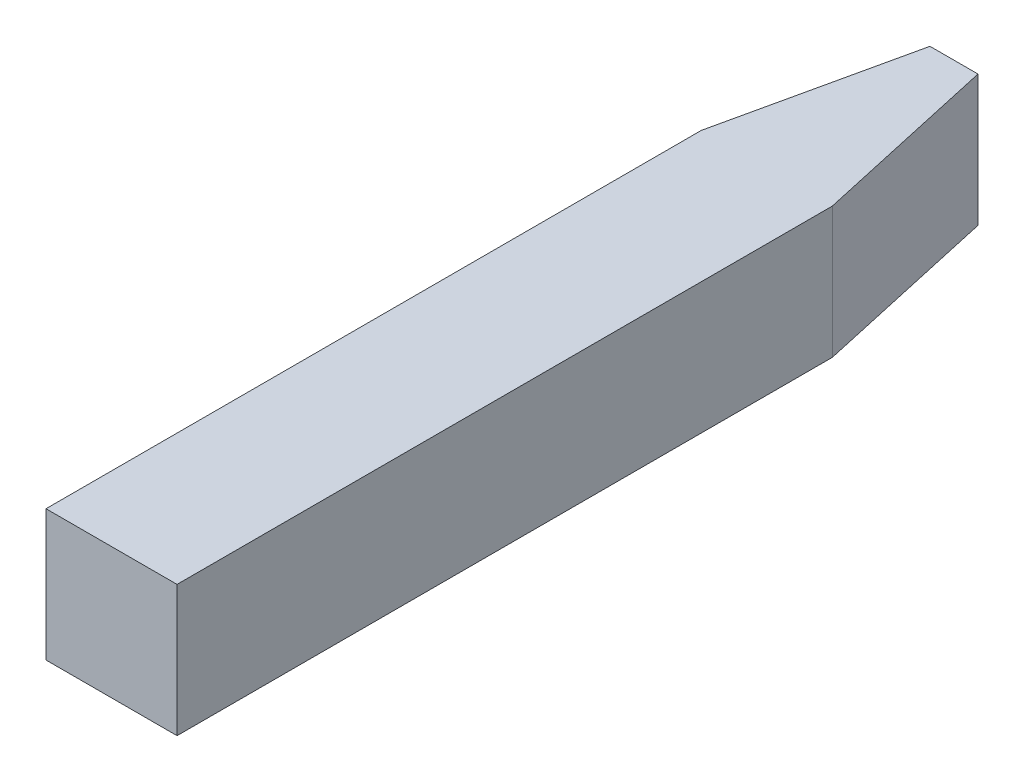
ISO-10303-21;
HEADER;
FILE_DESCRIPTION(('STEP AP214'),'2;1');
FILE_NAME('part.step','',(''),(''),'','','');
FILE_SCHEMA(('AUTOMOTIVE_DESIGN { 1 0 10303 214 1 1 1 1 }'));
ENDSEC;
DATA;
#1=APPLICATION_CONTEXT('core data for automotive mechanical design processes');
#2=APPLICATION_PROTOCOL_DEFINITION('international standard','automotive_design',2000,#1);
#3=PRODUCT_CONTEXT('',#1,'mechanical');
#4=PRODUCT('Part','Part','',(#3));
#5=PRODUCT_RELATED_PRODUCT_CATEGORY('part','',(#4));
#6=PRODUCT_DEFINITION_FORMATION('','',#4);
#7=PRODUCT_DEFINITION_CONTEXT('part definition',#1,'design');
#8=PRODUCT_DEFINITION('design','',#6,#7);
#9=PRODUCT_DEFINITION_SHAPE('','',#8);
#10=(LENGTH_UNIT() NAMED_UNIT(*) SI_UNIT(.MILLI.,.METRE.));
#11=(NAMED_UNIT(*) PLANE_ANGLE_UNIT() SI_UNIT($,.RADIAN.));
#12=(NAMED_UNIT(*) SI_UNIT($,.STERADIAN.) SOLID_ANGLE_UNIT());
#13=UNCERTAINTY_MEASURE_WITH_UNIT(LENGTH_MEASURE(1.E-05),#10,'distance_accuracy_value','');
#14=(GEOMETRIC_REPRESENTATION_CONTEXT(3) GLOBAL_UNCERTAINTY_ASSIGNED_CONTEXT((#13)) GLOBAL_UNIT_ASSIGNED_CONTEXT((#10,
#11,#12)) REPRESENTATION_CONTEXT('',''));
#15=CARTESIAN_POINT('',(0.,0.,0.));
#16=DIRECTION('',(0.,0.,1.));
#17=DIRECTION('',(1.,0.,0.));
#18=AXIS2_PLACEMENT_3D('',#15,#16,#17);
#19=CARTESIAN_POINT('',(1.46249685,7.76042,-3.61250314999995));
#20=DIRECTION('',(0.,1.,0.));
#21=DIRECTION('',(0.,0.,-1.));
#22=AXIS2_PLACEMENT_3D('',#19,#20,#21);
#23=PLANE('',#22);
#24=DIRECTION('',(-1.,0.,0.));
#25=VECTOR('',#24,1.);
#26=CARTESIAN_POINT('',(2.18,7.76042,0.999999999999105));
#27=LINE('',#26,#25);
#28=CARTESIAN_POINT('',(2.18,7.76042,0.999999999999104));
#29=VERTEX_POINT('',#28);
#30=CARTESIAN_POINT('',(1.48,7.76042,0.999999999999104));
#31=VERTEX_POINT('',#30);
#32=EDGE_CURVE('E27',#29,#31,#27,.T.);
#33=ORIENTED_EDGE('',*,*,#32,.F.);
#34=DIRECTION('',(0.,0.,1.));
#35=VECTOR('',#34,1.);
#36=CARTESIAN_POINT('',(2.18,7.76042,-2.5));
#37=LINE('',#36,#35);
#38=CARTESIAN_POINT('',(2.18,7.76042,-2.5));
#39=VERTEX_POINT('',#38);
#40=EDGE_CURVE('E95',#39,#29,#37,.T.);
#41=ORIENTED_EDGE('',*,*,#40,.F.);
#42=DIRECTION('',(0.216439613938066,0.,0.976296007119942));
#43=VECTOR('',#42,1.);
#44=CARTESIAN_POINT('',(1.95830533735709,7.76042,-3.5));
#45=LINE('',#44,#43);
#46=CARTESIAN_POINT('',(1.95830533735709,7.76042,-3.5));
#47=VERTEX_POINT('',#46);
#48=EDGE_CURVE('E90',#47,#39,#45,.T.);
#49=ORIENTED_EDGE('',*,*,#48,.F.);
#50=DIRECTION('',(1.,0.,0.));
#51=VECTOR('',#50,1.);
#52=CARTESIAN_POINT('',(1.70169466264301,7.76042,-3.5));
#53=LINE('',#52,#51);
#54=CARTESIAN_POINT('',(1.70169466264301,7.76042,-3.5));
#55=VERTEX_POINT('',#54);
#56=EDGE_CURVE('E92',#55,#47,#53,.T.);
#57=ORIENTED_EDGE('',*,*,#56,.F.);
#58=DIRECTION('',(0.216439613938066,0.,-0.976296007119942));
#59=VECTOR('',#58,1.);
#60=CARTESIAN_POINT('',(1.48,7.76042,-2.5));
#61=LINE('',#60,#59);
#62=CARTESIAN_POINT('',(1.48,7.76042,-2.5));
#63=VERTEX_POINT('',#62);
#64=EDGE_CURVE('E129',#63,#55,#61,.T.);
#65=ORIENTED_EDGE('',*,*,#64,.F.);
#66=DIRECTION('',(0.,0.,-1.));
#67=VECTOR('',#66,1.);
#68=CARTESIAN_POINT('',(1.48,7.76042,0.999999999999104));
#69=LINE('',#68,#67);
#70=EDGE_CURVE('E151',#31,#63,#69,.T.);
#71=ORIENTED_EDGE('',*,*,#70,.F.);
#72=EDGE_LOOP('',(#33,#41,#49,#57,#65,#71));
#73=FACE_BOUND('',#72,.T.);
#74=ADVANCED_FACE('F16',(#73),#23,.T.);
#75=CARTESIAN_POINT('',(1.46249685,7.06042,1.11250314999908));
#76=DIRECTION('',(0.,-1.,0.));
#77=DIRECTION('',(-1.,0.,0.));
#78=AXIS2_PLACEMENT_3D('',#75,#76,#77);
#79=PLANE('',#78);
#80=DIRECTION('',(-0.216439613938066,0.,0.976296007119942));
#81=VECTOR('',#80,1.);
#82=CARTESIAN_POINT('',(1.7016946626429,7.06042,-3.5));
#83=LINE('',#82,#81);
#84=CARTESIAN_POINT('',(1.70169466264301,7.06042,-3.5));
#85=VERTEX_POINT('',#84);
#86=CARTESIAN_POINT('',(1.48,7.06042,-2.5));
#87=VERTEX_POINT('',#86);
#88=EDGE_CURVE('E110',#85,#87,#83,.T.);
#89=ORIENTED_EDGE('',*,*,#88,.F.);
#90=DIRECTION('',(1.,0.,0.));
#91=VECTOR('',#90,1.);
#92=CARTESIAN_POINT('',(1.70169466264301,7.06042,-3.5));
#93=LINE('',#92,#91);
#94=CARTESIAN_POINT('',(1.95830533735709,7.06042,-3.5));
#95=VERTEX_POINT('',#94);
#96=EDGE_CURVE('E114',#85,#95,#93,.T.);
#97=ORIENTED_EDGE('',*,*,#96,.T.);
#98=DIRECTION('',(-0.216439613938066,0.,-0.976296007119942));
#99=VECTOR('',#98,1.);
#100=CARTESIAN_POINT('',(2.18,7.06042,-2.5));
#101=LINE('',#100,#99);
#102=CARTESIAN_POINT('',(2.18,7.06042,-2.5));
#103=VERTEX_POINT('',#102);
#104=EDGE_CURVE('E20',#103,#95,#101,.T.);
#105=ORIENTED_EDGE('',*,*,#104,.F.);
#106=DIRECTION('',(0.,0.,-1.));
#107=VECTOR('',#106,1.);
#108=CARTESIAN_POINT('',(2.18,7.06042,0.999999999999104));
#109=LINE('',#108,#107);
#110=CARTESIAN_POINT('',(2.18,7.06042,0.999999999999104));
#111=VERTEX_POINT('',#110);
#112=EDGE_CURVE('E131',#111,#103,#109,.T.);
#113=ORIENTED_EDGE('',*,*,#112,.F.);
#114=DIRECTION('',(1.,0.,0.));
#115=VECTOR('',#114,1.);
#116=CARTESIAN_POINT('',(1.48,7.06042,0.999999999999105));
#117=LINE('',#116,#115);
#118=CARTESIAN_POINT('',(1.48,7.06042,0.999999999999104));
#119=VERTEX_POINT('',#118);
#120=EDGE_CURVE('E11',#119,#111,#117,.T.);
#121=ORIENTED_EDGE('',*,*,#120,.F.);
#122=DIRECTION('',(0.,0.,1.));
#123=VECTOR('',#122,1.);
#124=CARTESIAN_POINT('',(1.48,7.06042,-2.5));
#125=LINE('',#124,#123);
#126=EDGE_CURVE('E125',#87,#119,#125,.T.);
#127=ORIENTED_EDGE('',*,*,#126,.F.);
#128=EDGE_LOOP('',(#89,#97,#105,#113,#121,#127));
#129=FACE_BOUND('',#128,.T.);
#130=ADVANCED_FACE('F341',(#129),#79,.T.);
#131=CARTESIAN_POINT('',(1.46249685,7.77792315000002,0.999999999999104));
#132=DIRECTION('',(0.,0.,-1.));
#133=DIRECTION('',(0.,-1.,0.));
#134=AXIS2_PLACEMENT_3D('',#131,#132,#133);
#135=PLANE('',#134);
#136=DIRECTION('',(0.,-1.,0.));
#137=VECTOR('',#136,1.);
#138=CARTESIAN_POINT('',(2.18,7.76042,0.999999999999104));
#139=LINE('',#138,#137);
#140=EDGE_CURVE('E100',#29,#111,#139,.T.);
#141=ORIENTED_EDGE('',*,*,#140,.F.);
#142=ORIENTED_EDGE('',*,*,#32,.T.);
#143=DIRECTION('',(0.,1.,0.));
#144=VECTOR('',#143,1.);
#145=CARTESIAN_POINT('',(1.48,7.06042,0.999999999999104));
#146=LINE('',#145,#144);
#147=EDGE_CURVE('E115',#119,#31,#146,.T.);
#148=ORIENTED_EDGE('',*,*,#147,.F.);
#149=ORIENTED_EDGE('',*,*,#120,.T.);
#150=EDGE_LOOP('',(#141,#142,#148,#149));
#151=FACE_BOUND('',#150,.T.);
#152=ADVANCED_FACE('F18',(#151),#135,.F.);
#153=CARTESIAN_POINT('',(1.95276228900624,7.04291685,-3.52500307533239));
#154=DIRECTION('',(-0.976296007119942,0.,0.216439613938066));
#155=DIRECTION('',(0.,1.,0.));
#156=AXIS2_PLACEMENT_3D('',#153,#154,#155);
#157=PLANE('',#156);
#158=ORIENTED_EDGE('',*,*,#48,.T.);
#159=DIRECTION('',(0.,-1.,0.));
#160=VECTOR('',#159,1.);
#161=CARTESIAN_POINT('',(2.18,7.76042,-2.5));
#162=LINE('',#161,#160);
#163=EDGE_CURVE('E133',#39,#103,#162,.T.);
#164=ORIENTED_EDGE('',*,*,#163,.T.);
#165=ORIENTED_EDGE('',*,*,#104,.T.);
#166=DIRECTION('',(0.,1.,0.));
#167=VECTOR('',#166,1.);
#168=CARTESIAN_POINT('',(1.95830533735709,7.06042,-3.5));
#169=LINE('',#168,#167);
#170=EDGE_CURVE('E106',#95,#47,#169,.T.);
#171=ORIENTED_EDGE('',*,*,#170,.T.);
#172=EDGE_LOOP('',(#158,#164,#165,#171));
#173=FACE_BOUND('',#172,.T.);
#174=ADVANCED_FACE('F112',(#173),#157,.F.);
#175=CARTESIAN_POINT('',(2.18,7.04291685,-2.58750314999996));
#176=DIRECTION('',(-1.,0.,0.));
#177=DIRECTION('',(0.,0.,1.));
#178=AXIS2_PLACEMENT_3D('',#175,#176,#177);
#179=PLANE('',#178);
#180=ORIENTED_EDGE('',*,*,#112,.T.);
#181=ORIENTED_EDGE('',*,*,#163,.F.);
#182=ORIENTED_EDGE('',*,*,#40,.T.);
#183=ORIENTED_EDGE('',*,*,#140,.T.);
#184=EDGE_LOOP('',(#180,#181,#182,#183));
#185=FACE_BOUND('',#184,.T.);
#186=ADVANCED_FACE('F294',(#185),#179,.F.);
#187=CARTESIAN_POINT('',(1.47445695164914,7.04291685,-2.47499692466756));
#188=DIRECTION('',(0.976296007119942,0.,0.216439613938066));
#189=DIRECTION('',(0.,-1.,0.));
#190=AXIS2_PLACEMENT_3D('',#187,#188,#189);
#191=PLANE('',#190);
#192=ORIENTED_EDGE('',*,*,#88,.T.);
#193=DIRECTION('',(0.,-1.,0.));
#194=VECTOR('',#193,1.);
#195=CARTESIAN_POINT('',(1.48,7.76042,-2.5));
#196=LINE('',#195,#194);
#197=EDGE_CURVE('E152',#63,#87,#196,.T.);
#198=ORIENTED_EDGE('',*,*,#197,.F.);
#199=ORIENTED_EDGE('',*,*,#64,.T.);
#200=DIRECTION('',(0.,-1.,0.));
#201=VECTOR('',#200,1.);
#202=CARTESIAN_POINT('',(1.70169466264301,7.76042,-3.5));
#203=LINE('',#202,#201);
#204=EDGE_CURVE('E108',#55,#85,#203,.T.);
#205=ORIENTED_EDGE('',*,*,#204,.T.);
#206=EDGE_LOOP('',(#192,#198,#199,#205));
#207=FACE_BOUND('',#206,.T.);
#208=ADVANCED_FACE('F305',(#207),#191,.F.);
#209=CARTESIAN_POINT('',(1.69527624577515,7.04291685,-3.5));
#210=DIRECTION('',(0.,0.,-1.));
#211=DIRECTION('',(0.,-1.,0.));
#212=AXIS2_PLACEMENT_3D('',#209,#210,#211);
#213=PLANE('',#212);
#214=ORIENTED_EDGE('',*,*,#170,.F.);
#215=ORIENTED_EDGE('',*,*,#96,.F.);
#216=ORIENTED_EDGE('',*,*,#204,.F.);
#217=ORIENTED_EDGE('',*,*,#56,.T.);
#218=EDGE_LOOP('',(#214,#215,#216,#217));
#219=FACE_BOUND('',#218,.T.);
#220=ADVANCED_FACE('F104',(#219),#213,.T.);
#221=CARTESIAN_POINT('',(1.48,7.04291685000001,1.08750314999908));
#222=DIRECTION('',(1.,0.,0.));
#223=DIRECTION('',(0.,0.,1.));
#224=AXIS2_PLACEMENT_3D('',#221,#222,#223);
#225=PLANE('',#224);
#226=ORIENTED_EDGE('',*,*,#70,.T.);
#227=ORIENTED_EDGE('',*,*,#197,.T.);
#228=ORIENTED_EDGE('',*,*,#126,.T.);
#229=ORIENTED_EDGE('',*,*,#147,.T.);
#230=EDGE_LOOP('',(#226,#227,#228,#229));
#231=FACE_BOUND('',#230,.T.);
#232=ADVANCED_FACE('F320',(#231),#225,.F.);
#233=CLOSED_SHELL('',(#74,#130,#152,#174,#186,#208,#220,#232));
#234=MANIFOLD_SOLID_BREP('B1',#233);
#235=ADVANCED_BREP_SHAPE_REPRESENTATION('',(#18,#234),#14);
#236=SHAPE_DEFINITION_REPRESENTATION(#9,#235);
ENDSEC;
END-ISO-10303-21;
